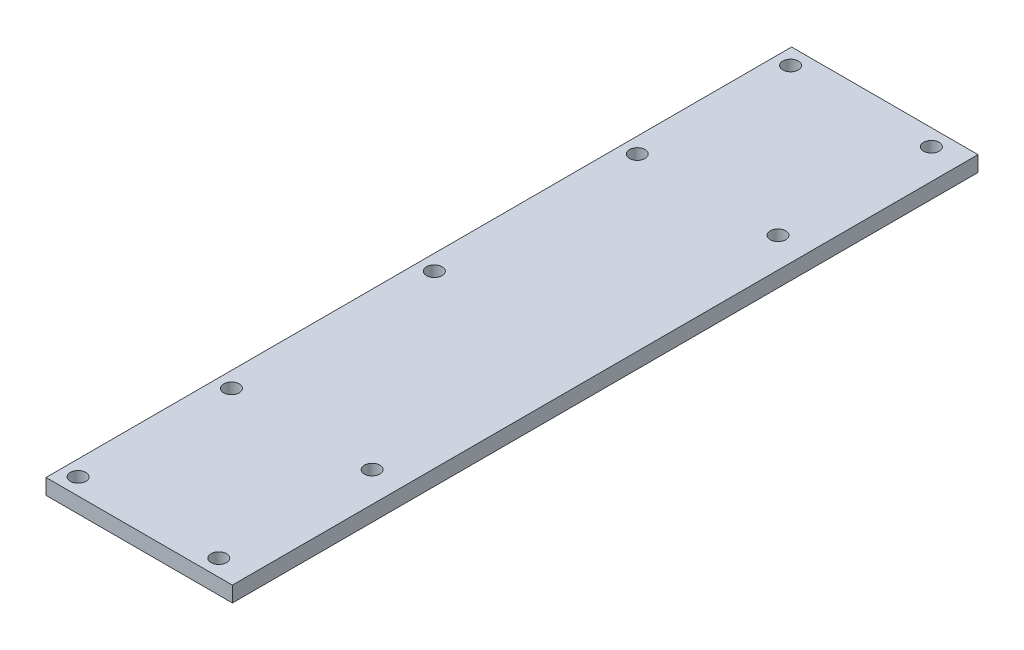
ISO-10303-21;
HEADER;
FILE_DESCRIPTION(('STEP AP214'),'2;1');
FILE_NAME('part.step','',(''),(''),'','','');
FILE_SCHEMA(('AUTOMOTIVE_DESIGN { 1 0 10303 214 1 1 1 1 }'));
ENDSEC;
DATA;
#1=APPLICATION_CONTEXT('core data for automotive mechanical design processes');
#2=APPLICATION_PROTOCOL_DEFINITION('international standard','automotive_design',2000,#1);
#3=PRODUCT_CONTEXT('',#1,'mechanical');
#4=PRODUCT('Part','Part','',(#3));
#5=PRODUCT_RELATED_PRODUCT_CATEGORY('part','',(#4));
#6=PRODUCT_DEFINITION_FORMATION('','',#4);
#7=PRODUCT_DEFINITION_CONTEXT('part definition',#1,'design');
#8=PRODUCT_DEFINITION('design','',#6,#7);
#9=PRODUCT_DEFINITION_SHAPE('','',#8);
#10=(LENGTH_UNIT() NAMED_UNIT(*) SI_UNIT(.MILLI.,.METRE.));
#11=(NAMED_UNIT(*) PLANE_ANGLE_UNIT() SI_UNIT($,.RADIAN.));
#12=(NAMED_UNIT(*) SI_UNIT($,.STERADIAN.) SOLID_ANGLE_UNIT());
#13=UNCERTAINTY_MEASURE_WITH_UNIT(LENGTH_MEASURE(1.E-05),#10,'distance_accuracy_value','');
#14=(GEOMETRIC_REPRESENTATION_CONTEXT(3) GLOBAL_UNCERTAINTY_ASSIGNED_CONTEXT((#13)) GLOBAL_UNIT_ASSIGNED_CONTEXT((#10,
#11,#12)) REPRESENTATION_CONTEXT('',''));
#15=CARTESIAN_POINT('',(0.,0.,0.));
#16=DIRECTION('',(0.,0.,1.));
#17=DIRECTION('',(1.,0.,0.));
#18=AXIS2_PLACEMENT_3D('',#15,#16,#17);
#19=CARTESIAN_POINT('',(-85.3722222222222,12.7,-92.075));
#20=DIRECTION('',(1.,0.,0.));
#21=DIRECTION('',(0.,0.,-1.));
#22=AXIS2_PLACEMENT_3D('',#19,#20,#21);
#23=PLANE('',#22);
#24=DIRECTION('',(0.,0.,1.));
#25=VECTOR('',#24,1.);
#26=CARTESIAN_POINT('',(-85.3722222222222,0.,-92.075));
#27=LINE('',#26,#25);
#28=CARTESIAN_POINT('',(-85.3722222222222,0.,-92.075));
#29=VERTEX_POINT('',#28);
#30=CARTESIAN_POINT('',(-85.3722222222221,0.,517.525));
#31=VERTEX_POINT('',#30);
#32=EDGE_CURVE('E95',#29,#31,#27,.T.);
#33=ORIENTED_EDGE('',*,*,#32,.T.);
#34=DIRECTION('',(0.,-1.,0.));
#35=VECTOR('',#34,1.);
#36=CARTESIAN_POINT('',(-85.3722222222221,12.7,517.525));
#37=LINE('',#36,#35);
#38=CARTESIAN_POINT('',(-85.3722222222221,12.7,517.525));
#39=VERTEX_POINT('',#38);
#40=EDGE_CURVE('E11',#39,#31,#37,.T.);
#41=ORIENTED_EDGE('',*,*,#40,.F.);
#42=DIRECTION('',(0.,0.,1.));
#43=VECTOR('',#42,1.);
#44=CARTESIAN_POINT('',(-85.3722222222222,12.7,-92.075));
#45=LINE('',#44,#43);
#46=CARTESIAN_POINT('',(-85.3722222222222,12.7,-92.075));
#47=VERTEX_POINT('',#46);
#48=EDGE_CURVE('E83',#47,#39,#45,.T.);
#49=ORIENTED_EDGE('',*,*,#48,.F.);
#50=DIRECTION('',(0.,-1.,0.));
#51=VECTOR('',#50,1.);
#52=CARTESIAN_POINT('',(-85.3722222222222,12.7,-92.075));
#53=LINE('',#52,#51);
#54=EDGE_CURVE('E91',#47,#29,#53,.T.);
#55=ORIENTED_EDGE('',*,*,#54,.T.);
#56=EDGE_LOOP('',(#33,#41,#49,#55));
#57=FACE_BOUND('',#56,.T.);
#58=ADVANCED_FACE('F32',(#57),#23,.F.);
#59=CARTESIAN_POINT('',(-85.3722222222221,12.7,517.525));
#60=DIRECTION('',(0.,0.,-1.));
#61=DIRECTION('',(-1.,0.,0.));
#62=AXIS2_PLACEMENT_3D('',#59,#60,#61);
#63=PLANE('',#62);
#64=DIRECTION('',(1.,0.,0.));
#65=VECTOR('',#64,1.);
#66=CARTESIAN_POINT('',(-85.3722222222221,0.,517.525));
#67=LINE('',#66,#65);
#68=CARTESIAN_POINT('',(67.0277777777779,0.,517.525));
#69=VERTEX_POINT('',#68);
#70=EDGE_CURVE('E87',#31,#69,#67,.T.);
#71=ORIENTED_EDGE('',*,*,#70,.T.);
#72=DIRECTION('',(0.,-1.,0.));
#73=VECTOR('',#72,1.);
#74=CARTESIAN_POINT('',(67.0277777777779,12.7,517.525));
#75=LINE('',#74,#73);
#76=CARTESIAN_POINT('',(67.0277777777779,12.7,517.525));
#77=VERTEX_POINT('',#76);
#78=EDGE_CURVE('E40',#77,#69,#75,.T.);
#79=ORIENTED_EDGE('',*,*,#78,.F.);
#80=DIRECTION('',(1.,0.,0.));
#81=VECTOR('',#80,1.);
#82=CARTESIAN_POINT('',(-85.3722222222221,12.7,517.525));
#83=LINE('',#82,#81);
#84=EDGE_CURVE('E78',#39,#77,#83,.T.);
#85=ORIENTED_EDGE('',*,*,#84,.F.);
#86=ORIENTED_EDGE('',*,*,#40,.T.);
#87=EDGE_LOOP('',(#71,#79,#85,#86));
#88=FACE_BOUND('',#87,.T.);
#89=ADVANCED_FACE('F86',(#88),#63,.F.);
#90=CARTESIAN_POINT('',(67.0277777777778,12.7,-92.075));
#91=DIRECTION('',(-1.,0.,0.));
#92=DIRECTION('',(0.,0.,1.));
#93=AXIS2_PLACEMENT_3D('',#90,#91,#92);
#94=PLANE('',#93);
#95=DIRECTION('',(0.,0.,-1.));
#96=VECTOR('',#95,1.);
#97=CARTESIAN_POINT('',(67.0277777777778,0.,-92.075));
#98=LINE('',#97,#96);
#99=CARTESIAN_POINT('',(67.0277777777778,0.,-92.075));
#100=VERTEX_POINT('',#99);
#101=EDGE_CURVE('E65',#69,#100,#98,.T.);
#102=ORIENTED_EDGE('',*,*,#101,.T.);
#103=DIRECTION('',(0.,-1.,0.));
#104=VECTOR('',#103,1.);
#105=CARTESIAN_POINT('',(67.0277777777778,12.7,-92.075));
#106=LINE('',#105,#104);
#107=CARTESIAN_POINT('',(67.0277777777778,12.7,-92.075));
#108=VERTEX_POINT('',#107);
#109=EDGE_CURVE('E88',#108,#100,#106,.T.);
#110=ORIENTED_EDGE('',*,*,#109,.F.);
#111=DIRECTION('',(0.,0.,-1.));
#112=VECTOR('',#111,1.);
#113=CARTESIAN_POINT('',(67.0277777777778,12.7,-92.075));
#114=LINE('',#113,#112);
#115=EDGE_CURVE('E81',#77,#108,#114,.T.);
#116=ORIENTED_EDGE('',*,*,#115,.F.);
#117=ORIENTED_EDGE('',*,*,#78,.T.);
#118=EDGE_LOOP('',(#102,#110,#116,#117));
#119=FACE_BOUND('',#118,.T.);
#120=ADVANCED_FACE('F89',(#119),#94,.F.);
#121=CARTESIAN_POINT('',(-85.3722222222222,12.7,-92.075));
#122=DIRECTION('',(0.,0.,1.));
#123=DIRECTION('',(1.,0.,0.));
#124=AXIS2_PLACEMENT_3D('',#121,#122,#123);
#125=PLANE('',#124);
#126=DIRECTION('',(-1.,0.,0.));
#127=VECTOR('',#126,1.);
#128=CARTESIAN_POINT('',(-85.3722222222222,0.,-92.075));
#129=LINE('',#128,#127);
#130=EDGE_CURVE('E71',#100,#29,#129,.T.);
#131=ORIENTED_EDGE('',*,*,#130,.T.);
#132=ORIENTED_EDGE('',*,*,#54,.F.);
#133=DIRECTION('',(-1.,0.,0.));
#134=VECTOR('',#133,1.);
#135=CARTESIAN_POINT('',(-85.3722222222222,12.7,-92.075));
#136=LINE('',#135,#134);
#137=EDGE_CURVE('E48',#108,#47,#136,.T.);
#138=ORIENTED_EDGE('',*,*,#137,.F.);
#139=ORIENTED_EDGE('',*,*,#109,.T.);
#140=EDGE_LOOP('',(#131,#132,#138,#139));
#141=FACE_BOUND('',#140,.T.);
#142=ADVANCED_FACE('F103',(#141),#125,.F.);
#143=CARTESIAN_POINT('',(0.,12.7,0.));
#144=DIRECTION('',(0.,1.,0.));
#145=DIRECTION('',(0.,0.,1.));
#146=AXIS2_PLACEMENT_3D('',#143,#144,#145);
#147=PLANE('',#146);
#148=CARTESIAN_POINT('',(-72.6722222222217,12.7,-78.5606741400404));
#149=DIRECTION('',(0.,1.,0.));
#150=DIRECTION('',(0.,0.,-1.));
#151=AXIS2_PLACEMENT_3D('',#148,#149,#150);
#152=CIRCLE('',#151,6.34999999999999);
#153=CARTESIAN_POINT('',(-72.6722222222217,12.7,-84.9106741400404));
#154=VERTEX_POINT('',#153);
#155=EDGE_CURVE('E115',#154,#154,#152,.T.);
#156=ORIENTED_EDGE('',*,*,#155,.F.);
#157=EDGE_LOOP('',(#156));
#158=FACE_BOUND('',#157,.T.);
#159=CARTESIAN_POINT('',(-72.6722222222218,12.7,46.8106741400404));
#160=DIRECTION('',(0.,1.,0.));
#161=DIRECTION('',(0.,0.,-1.));
#162=AXIS2_PLACEMENT_3D('',#159,#160,#161);
#163=CIRCLE('',#162,6.34999999999999);
#164=CARTESIAN_POINT('',(-72.6722222222218,12.7,40.4606741400404));
#165=VERTEX_POINT('',#164);
#166=EDGE_CURVE('E121',#165,#165,#163,.T.);
#167=ORIENTED_EDGE('',*,*,#166,.F.);
#168=EDGE_LOOP('',(#167));
#169=FACE_BOUND('',#168,.T.);
#170=CARTESIAN_POINT('',(42.3865967893734,12.7,-78.5606741400401));
#171=DIRECTION('',(0.,1.,0.));
#172=DIRECTION('',(0.,0.,-1.));
#173=AXIS2_PLACEMENT_3D('',#170,#171,#172);
#174=CIRCLE('',#173,6.35);
#175=CARTESIAN_POINT('',(42.3865967893734,12.7,-84.9106741400401));
#176=VERTEX_POINT('',#175);
#177=EDGE_CURVE('E127',#176,#176,#174,.T.);
#178=ORIENTED_EDGE('',*,*,#177,.F.);
#179=EDGE_LOOP('',(#178));
#180=FACE_BOUND('',#179,.T.);
#181=CARTESIAN_POINT('',(42.3865967893732,12.7,46.8106741400406));
#182=DIRECTION('',(0.,1.,0.));
#183=DIRECTION('',(0.,0.,-1.));
#184=AXIS2_PLACEMENT_3D('',#181,#182,#183);
#185=CIRCLE('',#184,6.34999999999995);
#186=CARTESIAN_POINT('',(42.3865967893732,12.7,40.4606741400406));
#187=VERTEX_POINT('',#186);
#188=EDGE_CURVE('E133',#187,#187,#185,.T.);
#189=ORIENTED_EDGE('',*,*,#188,.F.);
#190=EDGE_LOOP('',(#189));
#191=FACE_BOUND('',#190,.T.);
#192=CARTESIAN_POINT('',(42.3865967893728,12.7,378.63932585996));
#193=DIRECTION('',(0.,1.,0.));
#194=DIRECTION('',(0.,0.,1.));
#195=AXIS2_PLACEMENT_3D('',#192,#193,#194);
#196=CIRCLE('',#195,6.35);
#197=CARTESIAN_POINT('',(42.3865967893728,12.7,384.98932585996));
#198=VERTEX_POINT('',#197);
#199=EDGE_CURVE('E139',#198,#198,#196,.T.);
#200=ORIENTED_EDGE('',*,*,#199,.F.);
#201=EDGE_LOOP('',(#200));
#202=FACE_BOUND('',#201,.T.);
#203=CARTESIAN_POINT('',(42.3865967893727,12.7,504.01067414004));
#204=DIRECTION('',(0.,1.,0.));
#205=DIRECTION('',(0.,0.,1.));
#206=AXIS2_PLACEMENT_3D('',#203,#204,#205);
#207=CIRCLE('',#206,6.35);
#208=CARTESIAN_POINT('',(42.3865967893727,12.7,510.36067414004));
#209=VERTEX_POINT('',#208);
#210=EDGE_CURVE('E145',#209,#209,#207,.T.);
#211=ORIENTED_EDGE('',*,*,#210,.F.);
#212=EDGE_LOOP('',(#211));
#213=FACE_BOUND('',#212,.T.);
#214=CARTESIAN_POINT('',(-72.6722222222223,12.7,504.01067414004));
#215=DIRECTION('',(0.,1.,0.));
#216=DIRECTION('',(0.,0.,1.));
#217=AXIS2_PLACEMENT_3D('',#214,#215,#216);
#218=CIRCLE('',#217,6.34999999999999);
#219=CARTESIAN_POINT('',(-72.6722222222223,12.7,510.36067414004));
#220=VERTEX_POINT('',#219);
#221=EDGE_CURVE('E151',#220,#220,#218,.T.);
#222=ORIENTED_EDGE('',*,*,#221,.F.);
#223=EDGE_LOOP('',(#222));
#224=FACE_BOUND('',#223,.T.);
#225=CARTESIAN_POINT('',(-72.6722222222222,12.7,378.63932585996));
#226=DIRECTION('',(0.,1.,0.));
#227=DIRECTION('',(0.,0.,1.));
#228=AXIS2_PLACEMENT_3D('',#225,#226,#227);
#229=CIRCLE('',#228,6.34999999999999);
#230=CARTESIAN_POINT('',(-72.6722222222222,12.7,384.98932585996));
#231=VERTEX_POINT('',#230);
#232=EDGE_CURVE('E157',#231,#231,#229,.T.);
#233=ORIENTED_EDGE('',*,*,#232,.F.);
#234=EDGE_LOOP('',(#233));
#235=FACE_BOUND('',#234,.T.);
#236=CARTESIAN_POINT('',(-72.6722222222222,12.7,212.725));
#237=DIRECTION('',(0.,1.,0.));
#238=DIRECTION('',(0.,0.,1.));
#239=AXIS2_PLACEMENT_3D('',#236,#237,#238);
#240=CIRCLE('',#239,6.34999999999999);
#241=CARTESIAN_POINT('',(-72.6722222222222,12.7,219.075));
#242=VERTEX_POINT('',#241);
#243=EDGE_CURVE('E109',#242,#242,#240,.T.);
#244=ORIENTED_EDGE('',*,*,#243,.F.);
#245=EDGE_LOOP('',(#244));
#246=FACE_BOUND('',#245,.T.);
#247=ORIENTED_EDGE('',*,*,#48,.T.);
#248=ORIENTED_EDGE('',*,*,#84,.T.);
#249=ORIENTED_EDGE('',*,*,#115,.T.);
#250=ORIENTED_EDGE('',*,*,#137,.T.);
#251=EDGE_LOOP('',(#247,#248,#249,#250));
#252=FACE_BOUND('',#251,.T.);
#253=ADVANCED_FACE('F79',(#158,#169,#180,#191,#202,#213,#224,#235,#246,#252),#147,.T.);
#254=CARTESIAN_POINT('',(0.,0.,0.));
#255=DIRECTION('',(0.,1.,0.));
#256=DIRECTION('',(0.,0.,1.));
#257=AXIS2_PLACEMENT_3D('',#254,#255,#256);
#258=PLANE('',#257);
#259=CARTESIAN_POINT('',(-72.6722222222217,0.,-78.5606741400404));
#260=DIRECTION('',(0.,1.,0.));
#261=DIRECTION('',(0.,0.,-1.));
#262=AXIS2_PLACEMENT_3D('',#259,#260,#261);
#263=CIRCLE('',#262,6.34999999999999);
#264=CARTESIAN_POINT('',(-72.6722222222217,0.,-84.9106741400404));
#265=VERTEX_POINT('',#264);
#266=EDGE_CURVE('E118',#265,#265,#263,.T.);
#267=ORIENTED_EDGE('',*,*,#266,.T.);
#268=EDGE_LOOP('',(#267));
#269=FACE_BOUND('',#268,.T.);
#270=CARTESIAN_POINT('',(-72.6722222222218,0.,46.8106741400404));
#271=DIRECTION('',(0.,1.,0.));
#272=DIRECTION('',(0.,0.,-1.));
#273=AXIS2_PLACEMENT_3D('',#270,#271,#272);
#274=CIRCLE('',#273,6.34999999999999);
#275=CARTESIAN_POINT('',(-72.6722222222218,0.,40.4606741400404));
#276=VERTEX_POINT('',#275);
#277=EDGE_CURVE('E124',#276,#276,#274,.T.);
#278=ORIENTED_EDGE('',*,*,#277,.T.);
#279=EDGE_LOOP('',(#278));
#280=FACE_BOUND('',#279,.T.);
#281=CARTESIAN_POINT('',(42.3865967893734,0.,-78.5606741400401));
#282=DIRECTION('',(0.,1.,0.));
#283=DIRECTION('',(0.,0.,-1.));
#284=AXIS2_PLACEMENT_3D('',#281,#282,#283);
#285=CIRCLE('',#284,6.35);
#286=CARTESIAN_POINT('',(42.3865967893734,0.,-84.9106741400401));
#287=VERTEX_POINT('',#286);
#288=EDGE_CURVE('E130',#287,#287,#285,.T.);
#289=ORIENTED_EDGE('',*,*,#288,.T.);
#290=EDGE_LOOP('',(#289));
#291=FACE_BOUND('',#290,.T.);
#292=CARTESIAN_POINT('',(42.3865967893732,0.,46.8106741400406));
#293=DIRECTION('',(0.,1.,0.));
#294=DIRECTION('',(0.,0.,-1.));
#295=AXIS2_PLACEMENT_3D('',#292,#293,#294);
#296=CIRCLE('',#295,6.34999999999995);
#297=CARTESIAN_POINT('',(42.3865967893732,0.,40.4606741400406));
#298=VERTEX_POINT('',#297);
#299=EDGE_CURVE('E136',#298,#298,#296,.T.);
#300=ORIENTED_EDGE('',*,*,#299,.T.);
#301=EDGE_LOOP('',(#300));
#302=FACE_BOUND('',#301,.T.);
#303=CARTESIAN_POINT('',(42.3865967893728,0.,378.63932585996));
#304=DIRECTION('',(0.,1.,0.));
#305=DIRECTION('',(0.,0.,1.));
#306=AXIS2_PLACEMENT_3D('',#303,#304,#305);
#307=CIRCLE('',#306,6.35);
#308=CARTESIAN_POINT('',(42.3865967893728,0.,384.98932585996));
#309=VERTEX_POINT('',#308);
#310=EDGE_CURVE('E142',#309,#309,#307,.T.);
#311=ORIENTED_EDGE('',*,*,#310,.T.);
#312=EDGE_LOOP('',(#311));
#313=FACE_BOUND('',#312,.T.);
#314=CARTESIAN_POINT('',(42.3865967893727,0.,504.01067414004));
#315=DIRECTION('',(0.,1.,0.));
#316=DIRECTION('',(0.,0.,1.));
#317=AXIS2_PLACEMENT_3D('',#314,#315,#316);
#318=CIRCLE('',#317,6.35);
#319=CARTESIAN_POINT('',(42.3865967893727,0.,510.36067414004));
#320=VERTEX_POINT('',#319);
#321=EDGE_CURVE('E148',#320,#320,#318,.T.);
#322=ORIENTED_EDGE('',*,*,#321,.T.);
#323=EDGE_LOOP('',(#322));
#324=FACE_BOUND('',#323,.T.);
#325=CARTESIAN_POINT('',(-72.6722222222223,0.,504.01067414004));
#326=DIRECTION('',(0.,1.,0.));
#327=DIRECTION('',(0.,0.,1.));
#328=AXIS2_PLACEMENT_3D('',#325,#326,#327);
#329=CIRCLE('',#328,6.34999999999999);
#330=CARTESIAN_POINT('',(-72.6722222222223,0.,510.36067414004));
#331=VERTEX_POINT('',#330);
#332=EDGE_CURVE('E154',#331,#331,#329,.T.);
#333=ORIENTED_EDGE('',*,*,#332,.T.);
#334=EDGE_LOOP('',(#333));
#335=FACE_BOUND('',#334,.T.);
#336=CARTESIAN_POINT('',(-72.6722222222222,0.,378.63932585996));
#337=DIRECTION('',(0.,1.,0.));
#338=DIRECTION('',(0.,0.,1.));
#339=AXIS2_PLACEMENT_3D('',#336,#337,#338);
#340=CIRCLE('',#339,6.34999999999999);
#341=CARTESIAN_POINT('',(-72.6722222222222,0.,384.98932585996));
#342=VERTEX_POINT('',#341);
#343=EDGE_CURVE('E112',#342,#342,#340,.T.);
#344=ORIENTED_EDGE('',*,*,#343,.T.);
#345=EDGE_LOOP('',(#344));
#346=FACE_BOUND('',#345,.T.);
#347=CARTESIAN_POINT('',(-72.6722222222222,0.,212.725));
#348=DIRECTION('',(0.,1.,0.));
#349=DIRECTION('',(0.,0.,1.));
#350=AXIS2_PLACEMENT_3D('',#347,#348,#349);
#351=CIRCLE('',#350,6.34999999999999);
#352=CARTESIAN_POINT('',(-72.6722222222222,0.,219.075));
#353=VERTEX_POINT('',#352);
#354=EDGE_CURVE('E98',#353,#353,#351,.T.);
#355=ORIENTED_EDGE('',*,*,#354,.T.);
#356=EDGE_LOOP('',(#355));
#357=FACE_BOUND('',#356,.T.);
#358=ORIENTED_EDGE('',*,*,#32,.F.);
#359=ORIENTED_EDGE('',*,*,#130,.F.);
#360=ORIENTED_EDGE('',*,*,#101,.F.);
#361=ORIENTED_EDGE('',*,*,#70,.F.);
#362=EDGE_LOOP('',(#358,#359,#360,#361));
#363=FACE_BOUND('',#362,.T.);
#364=ADVANCED_FACE('F106',(#269,#280,#291,#302,#313,#324,#335,#346,#357,#363),#258,.F.);
#365=CARTESIAN_POINT('',(-72.6722222222222,0.,212.725));
#366=DIRECTION('',(0.,1.,0.));
#367=DIRECTION('',(0.,0.,1.));
#368=AXIS2_PLACEMENT_3D('',#365,#366,#367);
#369=CYLINDRICAL_SURFACE('',#368,6.34999999999999);
#370=ORIENTED_EDGE('',*,*,#354,.F.);
#371=EDGE_LOOP('',(#370));
#372=FACE_BOUND('',#371,.T.);
#373=ORIENTED_EDGE('',*,*,#243,.T.);
#374=EDGE_LOOP('',(#373));
#375=FACE_BOUND('',#374,.T.);
#376=ADVANCED_FACE('F169',(#372,#375),#369,.F.);
#377=CARTESIAN_POINT('',(-72.6722222222222,0.,378.63932585996));
#378=DIRECTION('',(0.,1.,0.));
#379=DIRECTION('',(0.,0.,1.));
#380=AXIS2_PLACEMENT_3D('',#377,#378,#379);
#381=CYLINDRICAL_SURFACE('',#380,6.34999999999999);
#382=ORIENTED_EDGE('',*,*,#343,.F.);
#383=EDGE_LOOP('',(#382));
#384=FACE_BOUND('',#383,.T.);
#385=ORIENTED_EDGE('',*,*,#232,.T.);
#386=EDGE_LOOP('',(#385));
#387=FACE_BOUND('',#386,.T.);
#388=ADVANCED_FACE('F165',(#384,#387),#381,.F.);
#389=CARTESIAN_POINT('',(-72.6722222222223,0.,504.01067414004));
#390=DIRECTION('',(0.,1.,0.));
#391=DIRECTION('',(0.,0.,1.));
#392=AXIS2_PLACEMENT_3D('',#389,#390,#391);
#393=CYLINDRICAL_SURFACE('',#392,6.34999999999999);
#394=ORIENTED_EDGE('',*,*,#332,.F.);
#395=EDGE_LOOP('',(#394));
#396=FACE_BOUND('',#395,.T.);
#397=ORIENTED_EDGE('',*,*,#221,.T.);
#398=EDGE_LOOP('',(#397));
#399=FACE_BOUND('',#398,.T.);
#400=ADVANCED_FACE('F168',(#396,#399),#393,.F.);
#401=CARTESIAN_POINT('',(42.3865967893727,0.,504.01067414004));
#402=DIRECTION('',(0.,1.,0.));
#403=DIRECTION('',(0.,0.,1.));
#404=AXIS2_PLACEMENT_3D('',#401,#402,#403);
#405=CYLINDRICAL_SURFACE('',#404,6.35);
#406=ORIENTED_EDGE('',*,*,#321,.F.);
#407=EDGE_LOOP('',(#406));
#408=FACE_BOUND('',#407,.T.);
#409=ORIENTED_EDGE('',*,*,#210,.T.);
#410=EDGE_LOOP('',(#409));
#411=FACE_BOUND('',#410,.T.);
#412=ADVANCED_FACE('F230',(#408,#411),#405,.F.);
#413=CARTESIAN_POINT('',(42.3865967893728,0.,378.63932585996));
#414=DIRECTION('',(0.,1.,0.));
#415=DIRECTION('',(0.,0.,1.));
#416=AXIS2_PLACEMENT_3D('',#413,#414,#415);
#417=CYLINDRICAL_SURFACE('',#416,6.35);
#418=ORIENTED_EDGE('',*,*,#310,.F.);
#419=EDGE_LOOP('',(#418));
#420=FACE_BOUND('',#419,.T.);
#421=ORIENTED_EDGE('',*,*,#199,.T.);
#422=EDGE_LOOP('',(#421));
#423=FACE_BOUND('',#422,.T.);
#424=ADVANCED_FACE('F240',(#420,#423),#417,.F.);
#425=CARTESIAN_POINT('',(42.3865967893732,0.,46.8106741400406));
#426=DIRECTION('',(0.,1.,0.));
#427=DIRECTION('',(0.,0.,1.));
#428=AXIS2_PLACEMENT_3D('',#425,#426,#427);
#429=CYLINDRICAL_SURFACE('',#428,6.34999999999995);
#430=ORIENTED_EDGE('',*,*,#299,.F.);
#431=EDGE_LOOP('',(#430));
#432=FACE_BOUND('',#431,.T.);
#433=ORIENTED_EDGE('',*,*,#188,.T.);
#434=EDGE_LOOP('',(#433));
#435=FACE_BOUND('',#434,.T.);
#436=ADVANCED_FACE('F250',(#432,#435),#429,.F.);
#437=CARTESIAN_POINT('',(42.3865967893734,0.,-78.5606741400401));
#438=DIRECTION('',(0.,1.,0.));
#439=DIRECTION('',(0.,0.,1.));
#440=AXIS2_PLACEMENT_3D('',#437,#438,#439);
#441=CYLINDRICAL_SURFACE('',#440,6.35);
#442=ORIENTED_EDGE('',*,*,#288,.F.);
#443=EDGE_LOOP('',(#442));
#444=FACE_BOUND('',#443,.T.);
#445=ORIENTED_EDGE('',*,*,#177,.T.);
#446=EDGE_LOOP('',(#445));
#447=FACE_BOUND('',#446,.T.);
#448=ADVANCED_FACE('F260',(#444,#447),#441,.F.);
#449=CARTESIAN_POINT('',(-72.6722222222218,0.,46.8106741400404));
#450=DIRECTION('',(0.,1.,0.));
#451=DIRECTION('',(0.,0.,1.));
#452=AXIS2_PLACEMENT_3D('',#449,#450,#451);
#453=CYLINDRICAL_SURFACE('',#452,6.34999999999999);
#454=ORIENTED_EDGE('',*,*,#277,.F.);
#455=EDGE_LOOP('',(#454));
#456=FACE_BOUND('',#455,.T.);
#457=ORIENTED_EDGE('',*,*,#166,.T.);
#458=EDGE_LOOP('',(#457));
#459=FACE_BOUND('',#458,.T.);
#460=ADVANCED_FACE('F270',(#456,#459),#453,.F.);
#461=CARTESIAN_POINT('',(-72.6722222222217,0.,-78.5606741400404));
#462=DIRECTION('',(0.,1.,0.));
#463=DIRECTION('',(0.,0.,1.));
#464=AXIS2_PLACEMENT_3D('',#461,#462,#463);
#465=CYLINDRICAL_SURFACE('',#464,6.34999999999999);
#466=ORIENTED_EDGE('',*,*,#266,.F.);
#467=EDGE_LOOP('',(#466));
#468=FACE_BOUND('',#467,.T.);
#469=ORIENTED_EDGE('',*,*,#155,.T.);
#470=EDGE_LOOP('',(#469));
#471=FACE_BOUND('',#470,.T.);
#472=ADVANCED_FACE('F280',(#468,#471),#465,.F.);
#473=CLOSED_SHELL('',(#58,#89,#120,#142,#253,#364,#376,#388,#400,#412,#424,#436,#448,#460,#472));
#474=MANIFOLD_SOLID_BREP('B2',#473);
#475=ADVANCED_BREP_SHAPE_REPRESENTATION('',(#18,#474),#14);
#476=SHAPE_DEFINITION_REPRESENTATION(#9,#475);
ENDSEC;
END-ISO-10303-21;
